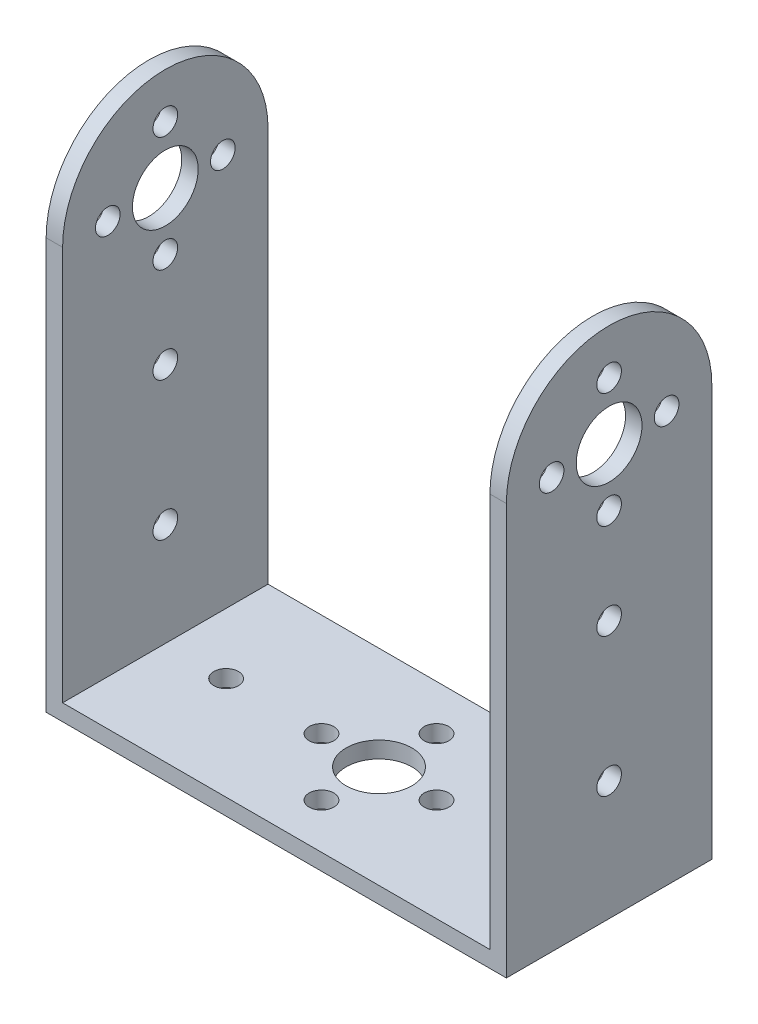
ISO-10303-21;
HEADER;
FILE_DESCRIPTION(('STEP AP214'),'2;1');
FILE_NAME('part.step','',(''),(''),'','','');
FILE_SCHEMA(('AUTOMOTIVE_DESIGN { 1 0 10303 214 1 1 1 1 }'));
ENDSEC;
DATA;
#1=APPLICATION_CONTEXT('core data for automotive mechanical design processes');
#2=APPLICATION_PROTOCOL_DEFINITION('international standard','automotive_design',2000,#1);
#3=PRODUCT_CONTEXT('',#1,'mechanical');
#4=PRODUCT('Part','Part','',(#3));
#5=PRODUCT_RELATED_PRODUCT_CATEGORY('part','',(#4));
#6=PRODUCT_DEFINITION_FORMATION('','',#4);
#7=PRODUCT_DEFINITION_CONTEXT('part definition',#1,'design');
#8=PRODUCT_DEFINITION('design','',#6,#7);
#9=PRODUCT_DEFINITION_SHAPE('','',#8);
#10=(LENGTH_UNIT() NAMED_UNIT(*) SI_UNIT(.MILLI.,.METRE.));
#11=(NAMED_UNIT(*) PLANE_ANGLE_UNIT() SI_UNIT($,.RADIAN.));
#12=(NAMED_UNIT(*) SI_UNIT($,.STERADIAN.) SOLID_ANGLE_UNIT());
#13=UNCERTAINTY_MEASURE_WITH_UNIT(LENGTH_MEASURE(1.E-05),#10,'distance_accuracy_value','');
#14=(GEOMETRIC_REPRESENTATION_CONTEXT(3) GLOBAL_UNCERTAINTY_ASSIGNED_CONTEXT((#13)) GLOBAL_UNIT_ASSIGNED_CONTEXT((#10,
#11,#12)) REPRESENTATION_CONTEXT('',''));
#15=CARTESIAN_POINT('',(0.,0.,0.));
#16=DIRECTION('',(0.,0.,1.));
#17=DIRECTION('',(1.,0.,0.));
#18=AXIS2_PLACEMENT_3D('',#15,#16,#17);
#19=CARTESIAN_POINT('',(0.,2.,0.));
#20=DIRECTION('',(0.,1.,0.));
#21=DIRECTION('',(0.,0.,1.));
#22=AXIS2_PLACEMENT_3D('',#19,#20,#21);
#23=PLANE('',#22);
#24=CARTESIAN_POINT('',(18.6,2.,0.));
#25=DIRECTION('',(0.,1.,0.));
#26=DIRECTION('',(0.,0.,1.));
#27=AXIS2_PLACEMENT_3D('',#24,#25,#26);
#28=CIRCLE('',#27,1.5);
#29=CARTESIAN_POINT('',(18.6,2.,1.5));
#30=VERTEX_POINT('',#29);
#31=EDGE_CURVE('E223',#30,#30,#28,.T.);
#32=ORIENTED_EDGE('',*,*,#31,.F.);
#33=EDGE_LOOP('',(#32));
#34=FACE_BOUND('',#33,.T.);
#35=CARTESIAN_POINT('',(0.,2.,7.));
#36=DIRECTION('',(0.,1.,0.));
#37=DIRECTION('',(0.,0.,1.));
#38=AXIS2_PLACEMENT_3D('',#35,#36,#37);
#39=CIRCLE('',#38,1.5);
#40=CARTESIAN_POINT('',(0.,2.,8.5));
#41=VERTEX_POINT('',#40);
#42=EDGE_CURVE('E235',#41,#41,#39,.T.);
#43=ORIENTED_EDGE('',*,*,#42,.F.);
#44=EDGE_LOOP('',(#43));
#45=FACE_BOUND('',#44,.T.);
#46=CARTESIAN_POINT('',(0.,2.,-7.));
#47=DIRECTION('',(0.,1.,0.));
#48=DIRECTION('',(0.,0.,1.));
#49=AXIS2_PLACEMENT_3D('',#46,#47,#48);
#50=CIRCLE('',#49,1.5);
#51=CARTESIAN_POINT('',(0.,2.,-5.5));
#52=VERTEX_POINT('',#51);
#53=EDGE_CURVE('E247',#52,#52,#50,.T.);
#54=ORIENTED_EDGE('',*,*,#53,.F.);
#55=EDGE_LOOP('',(#54));
#56=FACE_BOUND('',#55,.T.);
#57=DIRECTION('',(0.,0.,1.));
#58=VECTOR('',#57,1.);
#59=CARTESIAN_POINT('',(-26.,2.,12.5));
#60=LINE('',#59,#58);
#61=CARTESIAN_POINT('',(-26.,2.,-12.5));
#62=VERTEX_POINT('',#61);
#63=CARTESIAN_POINT('',(-26.,2.,12.5));
#64=VERTEX_POINT('',#63);
#65=EDGE_CURVE('E40',#62,#64,#60,.T.);
#66=ORIENTED_EDGE('',*,*,#65,.T.);
#67=DIRECTION('',(1.,0.,0.));
#68=VECTOR('',#67,1.);
#69=CARTESIAN_POINT('',(26.,2.,12.5));
#70=LINE('',#69,#68);
#71=CARTESIAN_POINT('',(26.,2.,12.5));
#72=VERTEX_POINT('',#71);
#73=EDGE_CURVE('E262',#64,#72,#70,.T.);
#74=ORIENTED_EDGE('',*,*,#73,.T.);
#75=DIRECTION('',(0.,0.,-1.));
#76=VECTOR('',#75,1.);
#77=CARTESIAN_POINT('',(26.,2.,12.5));
#78=LINE('',#77,#76);
#79=CARTESIAN_POINT('',(26.,2.,-12.5));
#80=VERTEX_POINT('',#79);
#81=EDGE_CURVE('E46',#72,#80,#78,.T.);
#82=ORIENTED_EDGE('',*,*,#81,.T.);
#83=DIRECTION('',(-1.,0.,0.));
#84=VECTOR('',#83,1.);
#85=CARTESIAN_POINT('',(26.,2.,-12.5));
#86=LINE('',#85,#84);
#87=EDGE_CURVE('E11',#80,#62,#86,.T.);
#88=ORIENTED_EDGE('',*,*,#87,.T.);
#89=EDGE_LOOP('',(#66,#74,#82,#88));
#90=FACE_BOUND('',#89,.T.);
#91=CARTESIAN_POINT('',(0.,2.,0.));
#92=DIRECTION('',(0.,1.,0.));
#93=DIRECTION('',(0.,0.,1.));
#94=AXIS2_PLACEMENT_3D('',#91,#92,#93);
#95=CIRCLE('',#94,4.);
#96=CARTESIAN_POINT('',(0.,2.,4.));
#97=VERTEX_POINT('',#96);
#98=EDGE_CURVE('E253',#97,#97,#95,.T.);
#99=ORIENTED_EDGE('',*,*,#98,.F.);
#100=EDGE_LOOP('',(#99));
#101=FACE_BOUND('',#100,.T.);
#102=CARTESIAN_POINT('',(7.,2.,0.));
#103=DIRECTION('',(0.,1.,0.));
#104=DIRECTION('',(0.,0.,1.));
#105=AXIS2_PLACEMENT_3D('',#102,#103,#104);
#106=CIRCLE('',#105,1.5);
#107=CARTESIAN_POINT('',(7.,2.,1.5));
#108=VERTEX_POINT('',#107);
#109=EDGE_CURVE('E241',#108,#108,#106,.T.);
#110=ORIENTED_EDGE('',*,*,#109,.F.);
#111=EDGE_LOOP('',(#110));
#112=FACE_BOUND('',#111,.T.);
#113=CARTESIAN_POINT('',(-7.,2.,0.));
#114=DIRECTION('',(0.,1.,0.));
#115=DIRECTION('',(0.,0.,1.));
#116=AXIS2_PLACEMENT_3D('',#113,#114,#115);
#117=CIRCLE('',#116,1.5);
#118=CARTESIAN_POINT('',(-7.,2.,1.5));
#119=VERTEX_POINT('',#118);
#120=EDGE_CURVE('E229',#119,#119,#117,.T.);
#121=ORIENTED_EDGE('',*,*,#120,.F.);
#122=EDGE_LOOP('',(#121));
#123=FACE_BOUND('',#122,.T.);
#124=CARTESIAN_POINT('',(-18.6,2.,0.));
#125=DIRECTION('',(0.,1.,0.));
#126=DIRECTION('',(0.,0.,1.));
#127=AXIS2_PLACEMENT_3D('',#124,#125,#126);
#128=CIRCLE('',#127,1.5);
#129=CARTESIAN_POINT('',(-18.6,2.,1.5));
#130=VERTEX_POINT('',#129);
#131=EDGE_CURVE('E216',#130,#130,#128,.T.);
#132=ORIENTED_EDGE('',*,*,#131,.F.);
#133=EDGE_LOOP('',(#132));
#134=FACE_BOUND('',#133,.T.);
#135=ADVANCED_FACE('F36',(#34,#45,#56,#90,#101,#112,#123,#134),#23,.T.);
#136=CARTESIAN_POINT('',(0.,0.,0.));
#137=DIRECTION('',(0.,1.,0.));
#138=DIRECTION('',(0.,0.,1.));
#139=AXIS2_PLACEMENT_3D('',#136,#137,#138);
#140=PLANE('',#139);
#141=CARTESIAN_POINT('',(18.6,0.,0.));
#142=DIRECTION('',(0.,1.,0.));
#143=DIRECTION('',(0.,0.,1.));
#144=AXIS2_PLACEMENT_3D('',#141,#142,#143);
#145=CIRCLE('',#144,1.5);
#146=CARTESIAN_POINT('',(18.6,0.,1.5));
#147=VERTEX_POINT('',#146);
#148=EDGE_CURVE('E219',#147,#147,#145,.T.);
#149=ORIENTED_EDGE('',*,*,#148,.T.);
#150=EDGE_LOOP('',(#149));
#151=FACE_BOUND('',#150,.T.);
#152=CARTESIAN_POINT('',(0.,0.,7.));
#153=DIRECTION('',(0.,1.,0.));
#154=DIRECTION('',(0.,0.,1.));
#155=AXIS2_PLACEMENT_3D('',#152,#153,#154);
#156=CIRCLE('',#155,1.5);
#157=CARTESIAN_POINT('',(0.,0.,8.5));
#158=VERTEX_POINT('',#157);
#159=EDGE_CURVE('E232',#158,#158,#156,.T.);
#160=ORIENTED_EDGE('',*,*,#159,.T.);
#161=EDGE_LOOP('',(#160));
#162=FACE_BOUND('',#161,.T.);
#163=CARTESIAN_POINT('',(0.,0.,-7.));
#164=DIRECTION('',(0.,1.,0.));
#165=DIRECTION('',(0.,0.,1.));
#166=AXIS2_PLACEMENT_3D('',#163,#164,#165);
#167=CIRCLE('',#166,1.5);
#168=CARTESIAN_POINT('',(0.,0.,-5.5));
#169=VERTEX_POINT('',#168);
#170=EDGE_CURVE('E244',#169,#169,#167,.T.);
#171=ORIENTED_EDGE('',*,*,#170,.T.);
#172=EDGE_LOOP('',(#171));
#173=FACE_BOUND('',#172,.T.);
#174=DIRECTION('',(1.,0.,0.));
#175=VECTOR('',#174,1.);
#176=CARTESIAN_POINT('',(26.,0.,12.5));
#177=LINE('',#176,#175);
#178=CARTESIAN_POINT('',(-28.,0.,12.5));
#179=VERTEX_POINT('',#178);
#180=CARTESIAN_POINT('',(28.,0.,12.5));
#181=VERTEX_POINT('',#180);
#182=EDGE_CURVE('E115',#179,#181,#177,.T.);
#183=ORIENTED_EDGE('',*,*,#182,.F.);
#184=DIRECTION('',(0.,0.,1.));
#185=VECTOR('',#184,1.);
#186=CARTESIAN_POINT('',(-28.,0.,-12.5));
#187=LINE('',#186,#185);
#188=CARTESIAN_POINT('',(-28.,0.,-12.5));
#189=VERTEX_POINT('',#188);
#190=EDGE_CURVE('E118',#189,#179,#187,.T.);
#191=ORIENTED_EDGE('',*,*,#190,.F.);
#192=DIRECTION('',(-1.,0.,0.));
#193=VECTOR('',#192,1.);
#194=CARTESIAN_POINT('',(26.,0.,-12.5));
#195=LINE('',#194,#193);
#196=CARTESIAN_POINT('',(28.,0.,-12.5));
#197=VERTEX_POINT('',#196);
#198=EDGE_CURVE('E104',#197,#189,#195,.T.);
#199=ORIENTED_EDGE('',*,*,#198,.F.);
#200=DIRECTION('',(0.,0.,-1.));
#201=VECTOR('',#200,1.);
#202=CARTESIAN_POINT('',(28.,0.,12.5));
#203=LINE('',#202,#201);
#204=EDGE_CURVE('E198',#181,#197,#203,.T.);
#205=ORIENTED_EDGE('',*,*,#204,.F.);
#206=EDGE_LOOP('',(#183,#191,#199,#205));
#207=FACE_BOUND('',#206,.T.);
#208=CARTESIAN_POINT('',(0.,0.,0.));
#209=DIRECTION('',(0.,1.,0.));
#210=DIRECTION('',(0.,0.,1.));
#211=AXIS2_PLACEMENT_3D('',#208,#209,#210);
#212=CIRCLE('',#211,4.);
#213=CARTESIAN_POINT('',(0.,0.,4.));
#214=VERTEX_POINT('',#213);
#215=EDGE_CURVE('E250',#214,#214,#212,.T.);
#216=ORIENTED_EDGE('',*,*,#215,.T.);
#217=EDGE_LOOP('',(#216));
#218=FACE_BOUND('',#217,.T.);
#219=CARTESIAN_POINT('',(7.,0.,0.));
#220=DIRECTION('',(0.,1.,0.));
#221=DIRECTION('',(0.,0.,1.));
#222=AXIS2_PLACEMENT_3D('',#219,#220,#221);
#223=CIRCLE('',#222,1.5);
#224=CARTESIAN_POINT('',(7.,0.,1.5));
#225=VERTEX_POINT('',#224);
#226=EDGE_CURVE('E238',#225,#225,#223,.T.);
#227=ORIENTED_EDGE('',*,*,#226,.T.);
#228=EDGE_LOOP('',(#227));
#229=FACE_BOUND('',#228,.T.);
#230=CARTESIAN_POINT('',(-7.,0.,0.));
#231=DIRECTION('',(0.,1.,0.));
#232=DIRECTION('',(0.,0.,1.));
#233=AXIS2_PLACEMENT_3D('',#230,#231,#232);
#234=CIRCLE('',#233,1.5);
#235=CARTESIAN_POINT('',(-7.,0.,1.5));
#236=VERTEX_POINT('',#235);
#237=EDGE_CURVE('E226',#236,#236,#234,.T.);
#238=ORIENTED_EDGE('',*,*,#237,.T.);
#239=EDGE_LOOP('',(#238));
#240=FACE_BOUND('',#239,.T.);
#241=CARTESIAN_POINT('',(-18.6,0.,0.));
#242=DIRECTION('',(0.,1.,0.));
#243=DIRECTION('',(0.,0.,1.));
#244=AXIS2_PLACEMENT_3D('',#241,#242,#243);
#245=CIRCLE('',#244,1.5);
#246=CARTESIAN_POINT('',(-18.6,0.,1.5));
#247=VERTEX_POINT('',#246);
#248=EDGE_CURVE('E220',#247,#247,#245,.T.);
#249=ORIENTED_EDGE('',*,*,#248,.T.);
#250=EDGE_LOOP('',(#249));
#251=FACE_BOUND('',#250,.T.);
#252=ADVANCED_FACE('F119',(#151,#162,#173,#207,#218,#229,#240,#251),#140,.F.);
#253=CARTESIAN_POINT('',(26.,2.,12.5));
#254=DIRECTION('',(0.,0.,-1.));
#255=DIRECTION('',(-1.,0.,0.));
#256=AXIS2_PLACEMENT_3D('',#253,#254,#255);
#257=PLANE('',#256);
#258=ORIENTED_EDGE('',*,*,#182,.T.);
#259=DIRECTION('',(0.,-1.,0.));
#260=VECTOR('',#259,1.);
#261=CARTESIAN_POINT('',(28.,0.,12.5));
#262=LINE('',#261,#260);
#263=CARTESIAN_POINT('',(28.,50.,12.5));
#264=VERTEX_POINT('',#263);
#265=EDGE_CURVE('E195',#264,#181,#262,.T.);
#266=ORIENTED_EDGE('',*,*,#265,.F.);
#267=DIRECTION('',(-1.,0.,0.));
#268=VECTOR('',#267,1.);
#269=CARTESIAN_POINT('',(28.,50.,12.5));
#270=LINE('',#269,#268);
#271=CARTESIAN_POINT('',(26.,50.,12.5));
#272=VERTEX_POINT('',#271);
#273=EDGE_CURVE('E204',#264,#272,#270,.T.);
#274=ORIENTED_EDGE('',*,*,#273,.T.);
#275=DIRECTION('',(0.,-1.,0.));
#276=VECTOR('',#275,1.);
#277=CARTESIAN_POINT('',(26.,0.,12.5));
#278=LINE('',#277,#276);
#279=EDGE_CURVE('E192',#272,#72,#278,.T.);
#280=ORIENTED_EDGE('',*,*,#279,.T.);
#281=ORIENTED_EDGE('',*,*,#73,.F.);
#282=DIRECTION('',(0.,1.,0.));
#283=VECTOR('',#282,1.);
#284=CARTESIAN_POINT('',(-26.,0.,12.5));
#285=LINE('',#284,#283);
#286=CARTESIAN_POINT('',(-26.,50.,12.5));
#287=VERTEX_POINT('',#286);
#288=EDGE_CURVE('E62',#64,#287,#285,.T.);
#289=ORIENTED_EDGE('',*,*,#288,.T.);
#290=DIRECTION('',(1.,0.,0.));
#291=VECTOR('',#290,1.);
#292=CARTESIAN_POINT('',(-28.,50.,12.5));
#293=LINE('',#292,#291);
#294=CARTESIAN_POINT('',(-28.,50.,12.5));
#295=VERTEX_POINT('',#294);
#296=EDGE_CURVE('E149',#295,#287,#293,.T.);
#297=ORIENTED_EDGE('',*,*,#296,.F.);
#298=DIRECTION('',(0.,1.,0.));
#299=VECTOR('',#298,1.);
#300=CARTESIAN_POINT('',(-28.,0.,12.5));
#301=LINE('',#300,#299);
#302=EDGE_CURVE('E123',#179,#295,#301,.T.);
#303=ORIENTED_EDGE('',*,*,#302,.F.);
#304=EDGE_LOOP('',(#258,#266,#274,#280,#281,#289,#297,#303));
#305=FACE_BOUND('',#304,.T.);
#306=ADVANCED_FACE('F38',(#305),#257,.F.);
#307=CARTESIAN_POINT('',(26.,2.,-12.5));
#308=DIRECTION('',(0.,0.,1.));
#309=DIRECTION('',(1.,0.,0.));
#310=AXIS2_PLACEMENT_3D('',#307,#308,#309);
#311=PLANE('',#310);
#312=ORIENTED_EDGE('',*,*,#198,.T.);
#313=DIRECTION('',(0.,-1.,0.));
#314=VECTOR('',#313,1.);
#315=CARTESIAN_POINT('',(-28.,0.,-12.5));
#316=LINE('',#315,#314);
#317=CARTESIAN_POINT('',(-28.,50.,-12.5));
#318=VERTEX_POINT('',#317);
#319=EDGE_CURVE('E109',#318,#189,#316,.T.);
#320=ORIENTED_EDGE('',*,*,#319,.F.);
#321=DIRECTION('',(1.,0.,0.));
#322=VECTOR('',#321,1.);
#323=CARTESIAN_POINT('',(-28.,50.,-12.5));
#324=LINE('',#323,#322);
#325=CARTESIAN_POINT('',(-26.,50.,-12.5));
#326=VERTEX_POINT('',#325);
#327=EDGE_CURVE('E139',#318,#326,#324,.T.);
#328=ORIENTED_EDGE('',*,*,#327,.T.);
#329=DIRECTION('',(0.,-1.,0.));
#330=VECTOR('',#329,1.);
#331=CARTESIAN_POINT('',(-26.,0.,-12.5));
#332=LINE('',#331,#330);
#333=EDGE_CURVE('E144',#326,#62,#332,.T.);
#334=ORIENTED_EDGE('',*,*,#333,.T.);
#335=ORIENTED_EDGE('',*,*,#87,.F.);
#336=DIRECTION('',(0.,1.,0.));
#337=VECTOR('',#336,1.);
#338=CARTESIAN_POINT('',(26.,0.,-12.5));
#339=LINE('',#338,#337);
#340=CARTESIAN_POINT('',(26.,50.,-12.5));
#341=VERTEX_POINT('',#340);
#342=EDGE_CURVE('E54',#80,#341,#339,.T.);
#343=ORIENTED_EDGE('',*,*,#342,.T.);
#344=DIRECTION('',(-1.,0.,0.));
#345=VECTOR('',#344,1.);
#346=CARTESIAN_POINT('',(28.,50.,-12.5));
#347=LINE('',#346,#345);
#348=CARTESIAN_POINT('',(28.,50.,-12.5));
#349=VERTEX_POINT('',#348);
#350=EDGE_CURVE('E213',#349,#341,#347,.T.);
#351=ORIENTED_EDGE('',*,*,#350,.F.);
#352=DIRECTION('',(0.,1.,0.));
#353=VECTOR('',#352,1.);
#354=CARTESIAN_POINT('',(28.,0.,-12.5));
#355=LINE('',#354,#353);
#356=EDGE_CURVE('E111',#197,#349,#355,.T.);
#357=ORIENTED_EDGE('',*,*,#356,.F.);
#358=EDGE_LOOP('',(#312,#320,#328,#334,#335,#343,#351,#357));
#359=FACE_BOUND('',#358,.T.);
#360=ADVANCED_FACE('F106',(#359),#311,.F.);
#361=CARTESIAN_POINT('',(0.,2.,0.));
#362=DIRECTION('',(0.,-1.,0.));
#363=DIRECTION('',(0.,0.,-1.));
#364=AXIS2_PLACEMENT_3D('',#361,#362,#363);
#365=CYLINDRICAL_SURFACE('',#364,4.);
#366=ORIENTED_EDGE('',*,*,#98,.T.);
#367=EDGE_LOOP('',(#366));
#368=FACE_BOUND('',#367,.T.);
#369=ORIENTED_EDGE('',*,*,#215,.F.);
#370=EDGE_LOOP('',(#369));
#371=FACE_BOUND('',#370,.T.);
#372=ADVANCED_FACE('F346',(#368,#371),#365,.F.);
#373=CARTESIAN_POINT('',(0.,2.,-7.));
#374=DIRECTION('',(0.,-1.,0.));
#375=DIRECTION('',(0.,0.,-1.));
#376=AXIS2_PLACEMENT_3D('',#373,#374,#375);
#377=CYLINDRICAL_SURFACE('',#376,1.5);
#378=ORIENTED_EDGE('',*,*,#53,.T.);
#379=EDGE_LOOP('',(#378));
#380=FACE_BOUND('',#379,.T.);
#381=ORIENTED_EDGE('',*,*,#170,.F.);
#382=EDGE_LOOP('',(#381));
#383=FACE_BOUND('',#382,.T.);
#384=ADVANCED_FACE('F353',(#380,#383),#377,.F.);
#385=CARTESIAN_POINT('',(7.,2.,0.));
#386=DIRECTION('',(0.,-1.,0.));
#387=DIRECTION('',(0.,0.,-1.));
#388=AXIS2_PLACEMENT_3D('',#385,#386,#387);
#389=CYLINDRICAL_SURFACE('',#388,1.5);
#390=ORIENTED_EDGE('',*,*,#109,.T.);
#391=EDGE_LOOP('',(#390));
#392=FACE_BOUND('',#391,.T.);
#393=ORIENTED_EDGE('',*,*,#226,.F.);
#394=EDGE_LOOP('',(#393));
#395=FACE_BOUND('',#394,.T.);
#396=ADVANCED_FACE('F483',(#392,#395),#389,.F.);
#397=CARTESIAN_POINT('',(0.,2.,7.));
#398=DIRECTION('',(0.,-1.,0.));
#399=DIRECTION('',(0.,0.,-1.));
#400=AXIS2_PLACEMENT_3D('',#397,#398,#399);
#401=CYLINDRICAL_SURFACE('',#400,1.5);
#402=ORIENTED_EDGE('',*,*,#42,.T.);
#403=EDGE_LOOP('',(#402));
#404=FACE_BOUND('',#403,.T.);
#405=ORIENTED_EDGE('',*,*,#159,.F.);
#406=EDGE_LOOP('',(#405));
#407=FACE_BOUND('',#406,.T.);
#408=ADVANCED_FACE('F473',(#404,#407),#401,.F.);
#409=CARTESIAN_POINT('',(-7.,2.,0.));
#410=DIRECTION('',(0.,-1.,0.));
#411=DIRECTION('',(0.,0.,-1.));
#412=AXIS2_PLACEMENT_3D('',#409,#410,#411);
#413=CYLINDRICAL_SURFACE('',#412,1.5);
#414=ORIENTED_EDGE('',*,*,#120,.T.);
#415=EDGE_LOOP('',(#414));
#416=FACE_BOUND('',#415,.T.);
#417=ORIENTED_EDGE('',*,*,#237,.F.);
#418=EDGE_LOOP('',(#417));
#419=FACE_BOUND('',#418,.T.);
#420=ADVANCED_FACE('F463',(#416,#419),#413,.F.);
#421=CARTESIAN_POINT('',(18.6,2.,0.));
#422=DIRECTION('',(0.,-1.,0.));
#423=DIRECTION('',(0.,0.,-1.));
#424=AXIS2_PLACEMENT_3D('',#421,#422,#423);
#425=CYLINDRICAL_SURFACE('',#424,1.5);
#426=ORIENTED_EDGE('',*,*,#31,.T.);
#427=EDGE_LOOP('',(#426));
#428=FACE_BOUND('',#427,.T.);
#429=ORIENTED_EDGE('',*,*,#148,.F.);
#430=EDGE_LOOP('',(#429));
#431=FACE_BOUND('',#430,.T.);
#432=ADVANCED_FACE('F453',(#428,#431),#425,.F.);
#433=CARTESIAN_POINT('',(-18.6,2.,0.));
#434=DIRECTION('',(0.,-1.,0.));
#435=DIRECTION('',(0.,0.,-1.));
#436=AXIS2_PLACEMENT_3D('',#433,#434,#435);
#437=CYLINDRICAL_SURFACE('',#436,1.5);
#438=ORIENTED_EDGE('',*,*,#131,.T.);
#439=EDGE_LOOP('',(#438));
#440=FACE_BOUND('',#439,.T.);
#441=ORIENTED_EDGE('',*,*,#248,.F.);
#442=EDGE_LOOP('',(#441));
#443=FACE_BOUND('',#442,.T.);
#444=ADVANCED_FACE('F311',(#440,#443),#437,.F.);
#445=CARTESIAN_POINT('',(26.,50.,0.));
#446=DIRECTION('',(-1.,0.,0.));
#447=DIRECTION('',(0.,0.,1.));
#448=AXIS2_PLACEMENT_3D('',#445,#446,#447);
#449=PLANE('',#448);
#450=CARTESIAN_POINT('',(26.,14.53,0.));
#451=DIRECTION('',(1.,0.,0.));
#452=DIRECTION('',(0.,0.,-1.));
#453=AXIS2_PLACEMENT_3D('',#450,#451,#452);
#454=CIRCLE('',#453,1.5);
#455=CARTESIAN_POINT('',(26.,14.53,-1.5));
#456=VERTEX_POINT('',#455);
#457=EDGE_CURVE('E156',#456,#456,#454,.T.);
#458=ORIENTED_EDGE('',*,*,#457,.T.);
#459=EDGE_LOOP('',(#458));
#460=FACE_BOUND('',#459,.T.);
#461=CARTESIAN_POINT('',(26.,50.,7.));
#462=DIRECTION('',(1.,0.,0.));
#463=DIRECTION('',(0.,0.,-1.));
#464=AXIS2_PLACEMENT_3D('',#461,#462,#463);
#465=CIRCLE('',#464,1.5);
#466=CARTESIAN_POINT('',(26.,50.,5.5));
#467=VERTEX_POINT('',#466);
#468=EDGE_CURVE('E162',#467,#467,#465,.T.);
#469=ORIENTED_EDGE('',*,*,#468,.T.);
#470=EDGE_LOOP('',(#469));
#471=FACE_BOUND('',#470,.T.);
#472=CARTESIAN_POINT('',(26.,50.,-7.));
#473=DIRECTION('',(1.,0.,0.));
#474=DIRECTION('',(0.,0.,-1.));
#475=AXIS2_PLACEMENT_3D('',#472,#473,#474);
#476=CIRCLE('',#475,1.5);
#477=CARTESIAN_POINT('',(26.,50.,-8.5));
#478=VERTEX_POINT('',#477);
#479=EDGE_CURVE('E174',#478,#478,#476,.T.);
#480=ORIENTED_EDGE('',*,*,#479,.T.);
#481=EDGE_LOOP('',(#480));
#482=FACE_BOUND('',#481,.T.);
#483=CARTESIAN_POINT('',(26.,50.,0.));
#484=DIRECTION('',(1.,0.,0.));
#485=DIRECTION('',(0.,0.,-1.));
#486=AXIS2_PLACEMENT_3D('',#483,#484,#485);
#487=CIRCLE('',#486,4.);
#488=CARTESIAN_POINT('',(26.,50.,-4.));
#489=VERTEX_POINT('',#488);
#490=EDGE_CURVE('E186',#489,#489,#487,.T.);
#491=ORIENTED_EDGE('',*,*,#490,.T.);
#492=EDGE_LOOP('',(#491));
#493=FACE_BOUND('',#492,.T.);
#494=CARTESIAN_POINT('',(26.,43.,0.));
#495=DIRECTION('',(1.,0.,0.));
#496=DIRECTION('',(0.,0.,-1.));
#497=AXIS2_PLACEMENT_3D('',#494,#495,#496);
#498=CIRCLE('',#497,1.5);
#499=CARTESIAN_POINT('',(26.,43.,-1.5));
#500=VERTEX_POINT('',#499);
#501=EDGE_CURVE('E180',#500,#500,#498,.T.);
#502=ORIENTED_EDGE('',*,*,#501,.T.);
#503=EDGE_LOOP('',(#502));
#504=FACE_BOUND('',#503,.T.);
#505=CARTESIAN_POINT('',(26.,57.,0.));
#506=DIRECTION('',(1.,0.,0.));
#507=DIRECTION('',(0.,0.,-1.));
#508=AXIS2_PLACEMENT_3D('',#505,#506,#507);
#509=CIRCLE('',#508,1.5);
#510=CARTESIAN_POINT('',(26.,57.,-1.5));
#511=VERTEX_POINT('',#510);
#512=EDGE_CURVE('E168',#511,#511,#509,.T.);
#513=ORIENTED_EDGE('',*,*,#512,.T.);
#514=EDGE_LOOP('',(#513));
#515=FACE_BOUND('',#514,.T.);
#516=CARTESIAN_POINT('',(26.,31.4,0.));
#517=DIRECTION('',(1.,0.,0.));
#518=DIRECTION('',(0.,0.,-1.));
#519=AXIS2_PLACEMENT_3D('',#516,#517,#518);
#520=CIRCLE('',#519,1.5);
#521=CARTESIAN_POINT('',(26.,31.4,-1.5));
#522=VERTEX_POINT('',#521);
#523=EDGE_CURVE('E155',#522,#522,#520,.T.);
#524=ORIENTED_EDGE('',*,*,#523,.T.);
#525=EDGE_LOOP('',(#524));
#526=FACE_BOUND('',#525,.T.);
#527=ORIENTED_EDGE('',*,*,#81,.F.);
#528=ORIENTED_EDGE('',*,*,#279,.F.);
#529=CARTESIAN_POINT('',(26.,50.,0.));
#530=DIRECTION('',(1.,0.,0.));
#531=DIRECTION('',(0.,0.,1.));
#532=AXIS2_PLACEMENT_3D('',#529,#530,#531);
#533=CIRCLE('',#532,12.5);
#534=EDGE_CURVE('E199',#341,#272,#533,.T.);
#535=ORIENTED_EDGE('',*,*,#534,.F.);
#536=ORIENTED_EDGE('',*,*,#342,.F.);
#537=EDGE_LOOP('',(#527,#528,#535,#536));
#538=FACE_BOUND('',#537,.T.);
#539=ADVANCED_FACE('F283',(#460,#471,#482,#493,#504,#515,#526,#538),#449,.T.);
#540=CARTESIAN_POINT('',(28.,50.,0.));
#541=DIRECTION('',(-1.,0.,0.));
#542=DIRECTION('',(0.,0.,1.));
#543=AXIS2_PLACEMENT_3D('',#540,#541,#542);
#544=PLANE('',#543);
#545=CARTESIAN_POINT('',(28.,31.4,0.));
#546=DIRECTION('',(1.,0.,0.));
#547=DIRECTION('',(0.,0.,-1.));
#548=AXIS2_PLACEMENT_3D('',#545,#546,#547);
#549=CIRCLE('',#548,1.5);
#550=CARTESIAN_POINT('',(28.,31.4,-1.5));
#551=VERTEX_POINT('',#550);
#552=EDGE_CURVE('E159',#551,#551,#549,.T.);
#553=ORIENTED_EDGE('',*,*,#552,.F.);
#554=EDGE_LOOP('',(#553));
#555=FACE_BOUND('',#554,.T.);
#556=CARTESIAN_POINT('',(28.,57.,0.));
#557=DIRECTION('',(1.,0.,0.));
#558=DIRECTION('',(0.,0.,-1.));
#559=AXIS2_PLACEMENT_3D('',#556,#557,#558);
#560=CIRCLE('',#559,1.5);
#561=CARTESIAN_POINT('',(28.,57.,-1.5));
#562=VERTEX_POINT('',#561);
#563=EDGE_CURVE('E171',#562,#562,#560,.T.);
#564=ORIENTED_EDGE('',*,*,#563,.F.);
#565=EDGE_LOOP('',(#564));
#566=FACE_BOUND('',#565,.T.);
#567=CARTESIAN_POINT('',(28.,43.,0.));
#568=DIRECTION('',(1.,0.,0.));
#569=DIRECTION('',(0.,0.,-1.));
#570=AXIS2_PLACEMENT_3D('',#567,#568,#569);
#571=CIRCLE('',#570,1.5);
#572=CARTESIAN_POINT('',(28.,43.,-1.5));
#573=VERTEX_POINT('',#572);
#574=EDGE_CURVE('E183',#573,#573,#571,.T.);
#575=ORIENTED_EDGE('',*,*,#574,.F.);
#576=EDGE_LOOP('',(#575));
#577=FACE_BOUND('',#576,.T.);
#578=ORIENTED_EDGE('',*,*,#265,.T.);
#579=ORIENTED_EDGE('',*,*,#204,.T.);
#580=ORIENTED_EDGE('',*,*,#356,.T.);
#581=CARTESIAN_POINT('',(28.,50.,0.));
#582=DIRECTION('',(1.,0.,0.));
#583=DIRECTION('',(0.,0.,1.));
#584=AXIS2_PLACEMENT_3D('',#581,#582,#583);
#585=CIRCLE('',#584,12.5);
#586=EDGE_CURVE('E202',#349,#264,#585,.T.);
#587=ORIENTED_EDGE('',*,*,#586,.T.);
#588=EDGE_LOOP('',(#578,#579,#580,#587));
#589=FACE_BOUND('',#588,.T.);
#590=CARTESIAN_POINT('',(28.,50.,0.));
#591=DIRECTION('',(1.,0.,0.));
#592=DIRECTION('',(0.,0.,-1.));
#593=AXIS2_PLACEMENT_3D('',#590,#591,#592);
#594=CIRCLE('',#593,4.);
#595=CARTESIAN_POINT('',(28.,50.,-4.));
#596=VERTEX_POINT('',#595);
#597=EDGE_CURVE('E189',#596,#596,#594,.T.);
#598=ORIENTED_EDGE('',*,*,#597,.F.);
#599=EDGE_LOOP('',(#598));
#600=FACE_BOUND('',#599,.T.);
#601=CARTESIAN_POINT('',(28.,50.,-7.));
#602=DIRECTION('',(1.,0.,0.));
#603=DIRECTION('',(0.,0.,-1.));
#604=AXIS2_PLACEMENT_3D('',#601,#602,#603);
#605=CIRCLE('',#604,1.5);
#606=CARTESIAN_POINT('',(28.,50.,-8.5));
#607=VERTEX_POINT('',#606);
#608=EDGE_CURVE('E177',#607,#607,#605,.T.);
#609=ORIENTED_EDGE('',*,*,#608,.F.);
#610=EDGE_LOOP('',(#609));
#611=FACE_BOUND('',#610,.T.);
#612=CARTESIAN_POINT('',(28.,50.,7.));
#613=DIRECTION('',(1.,0.,0.));
#614=DIRECTION('',(0.,0.,-1.));
#615=AXIS2_PLACEMENT_3D('',#612,#613,#614);
#616=CIRCLE('',#615,1.5);
#617=CARTESIAN_POINT('',(28.,50.,5.5));
#618=VERTEX_POINT('',#617);
#619=EDGE_CURVE('E165',#618,#618,#616,.T.);
#620=ORIENTED_EDGE('',*,*,#619,.F.);
#621=EDGE_LOOP('',(#620));
#622=FACE_BOUND('',#621,.T.);
#623=CARTESIAN_POINT('',(28.,14.53,0.));
#624=DIRECTION('',(1.,0.,0.));
#625=DIRECTION('',(0.,0.,-1.));
#626=AXIS2_PLACEMENT_3D('',#623,#624,#625);
#627=CIRCLE('',#626,1.5);
#628=CARTESIAN_POINT('',(28.,14.53,-1.5));
#629=VERTEX_POINT('',#628);
#630=EDGE_CURVE('E152',#629,#629,#627,.T.);
#631=ORIENTED_EDGE('',*,*,#630,.F.);
#632=EDGE_LOOP('',(#631));
#633=FACE_BOUND('',#632,.T.);
#634=ADVANCED_FACE('F289',(#555,#566,#577,#589,#600,#611,#622,#633),#544,.F.);
#635=CARTESIAN_POINT('',(28.,50.,0.));
#636=DIRECTION('',(-1.,0.,0.));
#637=DIRECTION('',(0.,0.,1.));
#638=AXIS2_PLACEMENT_3D('',#635,#636,#637);
#639=CYLINDRICAL_SURFACE('',#638,12.5);
#640=ORIENTED_EDGE('',*,*,#534,.T.);
#641=ORIENTED_EDGE('',*,*,#273,.F.);
#642=ORIENTED_EDGE('',*,*,#586,.F.);
#643=ORIENTED_EDGE('',*,*,#350,.T.);
#644=EDGE_LOOP('',(#640,#641,#642,#643));
#645=FACE_BOUND('',#644,.T.);
#646=ADVANCED_FACE('F287',(#645),#639,.T.);
#647=CARTESIAN_POINT('',(28.,50.,0.));
#648=DIRECTION('',(-1.,0.,0.));
#649=DIRECTION('',(0.,0.,1.));
#650=AXIS2_PLACEMENT_3D('',#647,#648,#649);
#651=CYLINDRICAL_SURFACE('',#650,4.);
#652=ORIENTED_EDGE('',*,*,#597,.T.);
#653=EDGE_LOOP('',(#652));
#654=FACE_BOUND('',#653,.T.);
#655=ORIENTED_EDGE('',*,*,#490,.F.);
#656=EDGE_LOOP('',(#655));
#657=FACE_BOUND('',#656,.T.);
#658=ADVANCED_FACE('F413',(#654,#657),#651,.F.);
#659=CARTESIAN_POINT('',(28.,43.,0.));
#660=DIRECTION('',(-1.,0.,0.));
#661=DIRECTION('',(0.,0.,1.));
#662=AXIS2_PLACEMENT_3D('',#659,#660,#661);
#663=CYLINDRICAL_SURFACE('',#662,1.5);
#664=ORIENTED_EDGE('',*,*,#574,.T.);
#665=EDGE_LOOP('',(#664));
#666=FACE_BOUND('',#665,.T.);
#667=ORIENTED_EDGE('',*,*,#501,.F.);
#668=EDGE_LOOP('',(#667));
#669=FACE_BOUND('',#668,.T.);
#670=ADVANCED_FACE('F403',(#666,#669),#663,.F.);
#671=CARTESIAN_POINT('',(28.,50.,-7.));
#672=DIRECTION('',(-1.,0.,0.));
#673=DIRECTION('',(0.,0.,1.));
#674=AXIS2_PLACEMENT_3D('',#671,#672,#673);
#675=CYLINDRICAL_SURFACE('',#674,1.5);
#676=ORIENTED_EDGE('',*,*,#608,.T.);
#677=EDGE_LOOP('',(#676));
#678=FACE_BOUND('',#677,.T.);
#679=ORIENTED_EDGE('',*,*,#479,.F.);
#680=EDGE_LOOP('',(#679));
#681=FACE_BOUND('',#680,.T.);
#682=ADVANCED_FACE('F393',(#678,#681),#675,.F.);
#683=CARTESIAN_POINT('',(28.,57.,0.));
#684=DIRECTION('',(-1.,0.,0.));
#685=DIRECTION('',(0.,0.,1.));
#686=AXIS2_PLACEMENT_3D('',#683,#684,#685);
#687=CYLINDRICAL_SURFACE('',#686,1.5);
#688=ORIENTED_EDGE('',*,*,#563,.T.);
#689=EDGE_LOOP('',(#688));
#690=FACE_BOUND('',#689,.T.);
#691=ORIENTED_EDGE('',*,*,#512,.F.);
#692=EDGE_LOOP('',(#691));
#693=FACE_BOUND('',#692,.T.);
#694=ADVANCED_FACE('F332',(#690,#693),#687,.F.);
#695=CARTESIAN_POINT('',(28.,50.,7.));
#696=DIRECTION('',(-1.,0.,0.));
#697=DIRECTION('',(0.,0.,1.));
#698=AXIS2_PLACEMENT_3D('',#695,#696,#697);
#699=CYLINDRICAL_SURFACE('',#698,1.5);
#700=ORIENTED_EDGE('',*,*,#619,.T.);
#701=EDGE_LOOP('',(#700));
#702=FACE_BOUND('',#701,.T.);
#703=ORIENTED_EDGE('',*,*,#468,.F.);
#704=EDGE_LOOP('',(#703));
#705=FACE_BOUND('',#704,.T.);
#706=ADVANCED_FACE('F326',(#702,#705),#699,.F.);
#707=CARTESIAN_POINT('',(28.,31.4,0.));
#708=DIRECTION('',(-1.,0.,0.));
#709=DIRECTION('',(0.,0.,1.));
#710=AXIS2_PLACEMENT_3D('',#707,#708,#709);
#711=CYLINDRICAL_SURFACE('',#710,1.5);
#712=ORIENTED_EDGE('',*,*,#552,.T.);
#713=EDGE_LOOP('',(#712));
#714=FACE_BOUND('',#713,.T.);
#715=ORIENTED_EDGE('',*,*,#523,.F.);
#716=EDGE_LOOP('',(#715));
#717=FACE_BOUND('',#716,.T.);
#718=ADVANCED_FACE('F305',(#714,#717),#711,.F.);
#719=CARTESIAN_POINT('',(28.,14.53,0.));
#720=DIRECTION('',(-1.,0.,0.));
#721=DIRECTION('',(0.,0.,1.));
#722=AXIS2_PLACEMENT_3D('',#719,#720,#721);
#723=CYLINDRICAL_SURFACE('',#722,1.5);
#724=ORIENTED_EDGE('',*,*,#630,.T.);
#725=EDGE_LOOP('',(#724));
#726=FACE_BOUND('',#725,.T.);
#727=ORIENTED_EDGE('',*,*,#457,.F.);
#728=EDGE_LOOP('',(#727));
#729=FACE_BOUND('',#728,.T.);
#730=ADVANCED_FACE('F302',(#726,#729),#723,.F.);
#731=CARTESIAN_POINT('',(-26.,50.,0.));
#732=DIRECTION('',(1.,0.,0.));
#733=DIRECTION('',(0.,0.,-1.));
#734=AXIS2_PLACEMENT_3D('',#731,#732,#733);
#735=PLANE('',#734);
#736=CARTESIAN_POINT('',(-26.,14.53,0.));
#737=DIRECTION('',(-1.,0.,0.));
#738=DIRECTION('',(0.,0.,1.));
#739=AXIS2_PLACEMENT_3D('',#736,#737,#738);
#740=CIRCLE('',#739,1.5);
#741=CARTESIAN_POINT('',(-26.,14.53,1.5));
#742=VERTEX_POINT('',#741);
#743=EDGE_CURVE('E633',#742,#742,#740,.T.);
#744=ORIENTED_EDGE('',*,*,#743,.T.);
#745=EDGE_LOOP('',(#744));
#746=FACE_BOUND('',#745,.T.);
#747=CARTESIAN_POINT('',(-26.,43.,0.));
#748=DIRECTION('',(-1.,0.,0.));
#749=DIRECTION('',(0.,0.,1.));
#750=AXIS2_PLACEMENT_3D('',#747,#748,#749);
#751=CIRCLE('',#750,1.5);
#752=CARTESIAN_POINT('',(-26.,43.,1.5));
#753=VERTEX_POINT('',#752);
#754=EDGE_CURVE('E641',#753,#753,#751,.T.);
#755=ORIENTED_EDGE('',*,*,#754,.T.);
#756=EDGE_LOOP('',(#755));
#757=FACE_BOUND('',#756,.T.);
#758=CARTESIAN_POINT('',(-26.,50.,7.));
#759=DIRECTION('',(-1.,0.,0.));
#760=DIRECTION('',(0.,0.,1.));
#761=AXIS2_PLACEMENT_3D('',#758,#759,#760);
#762=CIRCLE('',#761,1.5);
#763=CARTESIAN_POINT('',(-26.,50.,8.5));
#764=VERTEX_POINT('',#763);
#765=EDGE_CURVE('E653',#764,#764,#762,.T.);
#766=ORIENTED_EDGE('',*,*,#765,.T.);
#767=EDGE_LOOP('',(#766));
#768=FACE_BOUND('',#767,.T.);
#769=CARTESIAN_POINT('',(-26.,50.,0.));
#770=DIRECTION('',(-1.,0.,0.));
#771=DIRECTION('',(0.,0.,1.));
#772=AXIS2_PLACEMENT_3D('',#769,#770,#771);
#773=CIRCLE('',#772,4.);
#774=CARTESIAN_POINT('',(-26.,50.,4.));
#775=VERTEX_POINT('',#774);
#776=EDGE_CURVE('E134',#775,#775,#773,.T.);
#777=ORIENTED_EDGE('',*,*,#776,.T.);
#778=EDGE_LOOP('',(#777));
#779=FACE_BOUND('',#778,.T.);
#780=CARTESIAN_POINT('',(-26.,57.,0.));
#781=DIRECTION('',(-1.,0.,0.));
#782=DIRECTION('',(0.,0.,1.));
#783=AXIS2_PLACEMENT_3D('',#780,#781,#782);
#784=CIRCLE('',#783,1.5);
#785=CARTESIAN_POINT('',(-26.,57.,1.5));
#786=VERTEX_POINT('',#785);
#787=EDGE_CURVE('E659',#786,#786,#784,.T.);
#788=ORIENTED_EDGE('',*,*,#787,.T.);
#789=EDGE_LOOP('',(#788));
#790=FACE_BOUND('',#789,.T.);
#791=CARTESIAN_POINT('',(-26.,50.,-7.));
#792=DIRECTION('',(-1.,0.,0.));
#793=DIRECTION('',(0.,0.,1.));
#794=AXIS2_PLACEMENT_3D('',#791,#792,#793);
#795=CIRCLE('',#794,1.5);
#796=CARTESIAN_POINT('',(-26.,50.,-5.50000000000001));
#797=VERTEX_POINT('',#796);
#798=EDGE_CURVE('E647',#797,#797,#795,.T.);
#799=ORIENTED_EDGE('',*,*,#798,.T.);
#800=EDGE_LOOP('',(#799));
#801=FACE_BOUND('',#800,.T.);
#802=CARTESIAN_POINT('',(-26.,31.4,0.));
#803=DIRECTION('',(-1.,0.,0.));
#804=DIRECTION('',(0.,0.,1.));
#805=AXIS2_PLACEMENT_3D('',#802,#803,#804);
#806=CIRCLE('',#805,1.5);
#807=CARTESIAN_POINT('',(-26.,31.4,1.5));
#808=VERTEX_POINT('',#807);
#809=EDGE_CURVE('E635',#808,#808,#806,.T.);
#810=ORIENTED_EDGE('',*,*,#809,.T.);
#811=EDGE_LOOP('',(#810));
#812=FACE_BOUND('',#811,.T.);
#813=ORIENTED_EDGE('',*,*,#65,.F.);
#814=ORIENTED_EDGE('',*,*,#333,.F.);
#815=CARTESIAN_POINT('',(-26.,50.,0.));
#816=DIRECTION('',(-1.,0.,0.));
#817=DIRECTION('',(0.,0.,-1.));
#818=AXIS2_PLACEMENT_3D('',#815,#816,#817);
#819=CIRCLE('',#818,12.5);
#820=EDGE_CURVE('E130',#287,#326,#819,.T.);
#821=ORIENTED_EDGE('',*,*,#820,.F.);
#822=ORIENTED_EDGE('',*,*,#288,.F.);
#823=EDGE_LOOP('',(#813,#814,#821,#822));
#824=FACE_BOUND('',#823,.T.);
#825=ADVANCED_FACE('F273',(#746,#757,#768,#779,#790,#801,#812,#824),#735,.T.);
#826=CARTESIAN_POINT('',(-28.,50.,0.));
#827=DIRECTION('',(1.,0.,0.));
#828=DIRECTION('',(0.,0.,-1.));
#829=AXIS2_PLACEMENT_3D('',#826,#827,#828);
#830=PLANE('',#829);
#831=CARTESIAN_POINT('',(-28.,31.4,0.));
#832=DIRECTION('',(-1.,0.,0.));
#833=DIRECTION('',(0.,0.,1.));
#834=AXIS2_PLACEMENT_3D('',#831,#832,#833);
#835=CIRCLE('',#834,1.5);
#836=CARTESIAN_POINT('',(-28.,31.4,1.5));
#837=VERTEX_POINT('',#836);
#838=EDGE_CURVE('E638',#837,#837,#835,.T.);
#839=ORIENTED_EDGE('',*,*,#838,.F.);
#840=EDGE_LOOP('',(#839));
#841=FACE_BOUND('',#840,.T.);
#842=CARTESIAN_POINT('',(-28.,50.,-7.));
#843=DIRECTION('',(-1.,0.,0.));
#844=DIRECTION('',(0.,0.,1.));
#845=AXIS2_PLACEMENT_3D('',#842,#843,#844);
#846=CIRCLE('',#845,1.5);
#847=CARTESIAN_POINT('',(-28.,50.,-5.50000000000001));
#848=VERTEX_POINT('',#847);
#849=EDGE_CURVE('E650',#848,#848,#846,.T.);
#850=ORIENTED_EDGE('',*,*,#849,.F.);
#851=EDGE_LOOP('',(#850));
#852=FACE_BOUND('',#851,.T.);
#853=CARTESIAN_POINT('',(-28.,57.,0.));
#854=DIRECTION('',(-1.,0.,0.));
#855=DIRECTION('',(0.,0.,1.));
#856=AXIS2_PLACEMENT_3D('',#853,#854,#855);
#857=CIRCLE('',#856,1.5);
#858=CARTESIAN_POINT('',(-28.,57.,1.5));
#859=VERTEX_POINT('',#858);
#860=EDGE_CURVE('E662',#859,#859,#857,.T.);
#861=ORIENTED_EDGE('',*,*,#860,.F.);
#862=EDGE_LOOP('',(#861));
#863=FACE_BOUND('',#862,.T.);
#864=ORIENTED_EDGE('',*,*,#319,.T.);
#865=ORIENTED_EDGE('',*,*,#190,.T.);
#866=ORIENTED_EDGE('',*,*,#302,.T.);
#867=CARTESIAN_POINT('',(-28.,50.,0.));
#868=DIRECTION('',(-1.,0.,0.));
#869=DIRECTION('',(0.,0.,-1.));
#870=AXIS2_PLACEMENT_3D('',#867,#868,#869);
#871=CIRCLE('',#870,12.5);
#872=EDGE_CURVE('E128',#295,#318,#871,.T.);
#873=ORIENTED_EDGE('',*,*,#872,.T.);
#874=EDGE_LOOP('',(#864,#865,#866,#873));
#875=FACE_BOUND('',#874,.T.);
#876=CARTESIAN_POINT('',(-28.,50.,0.));
#877=DIRECTION('',(-1.,0.,0.));
#878=DIRECTION('',(0.,0.,1.));
#879=AXIS2_PLACEMENT_3D('',#876,#877,#878);
#880=CIRCLE('',#879,4.);
#881=CARTESIAN_POINT('',(-28.,50.,4.));
#882=VERTEX_POINT('',#881);
#883=EDGE_CURVE('E148',#882,#882,#880,.T.);
#884=ORIENTED_EDGE('',*,*,#883,.F.);
#885=EDGE_LOOP('',(#884));
#886=FACE_BOUND('',#885,.T.);
#887=CARTESIAN_POINT('',(-28.,50.,7.));
#888=DIRECTION('',(-1.,0.,0.));
#889=DIRECTION('',(0.,0.,1.));
#890=AXIS2_PLACEMENT_3D('',#887,#888,#889);
#891=CIRCLE('',#890,1.5);
#892=CARTESIAN_POINT('',(-28.,50.,8.5));
#893=VERTEX_POINT('',#892);
#894=EDGE_CURVE('E656',#893,#893,#891,.T.);
#895=ORIENTED_EDGE('',*,*,#894,.F.);
#896=EDGE_LOOP('',(#895));
#897=FACE_BOUND('',#896,.T.);
#898=CARTESIAN_POINT('',(-28.,43.,0.));
#899=DIRECTION('',(-1.,0.,0.));
#900=DIRECTION('',(0.,0.,1.));
#901=AXIS2_PLACEMENT_3D('',#898,#899,#900);
#902=CIRCLE('',#901,1.5);
#903=CARTESIAN_POINT('',(-28.,43.,1.5));
#904=VERTEX_POINT('',#903);
#905=EDGE_CURVE('E644',#904,#904,#902,.T.);
#906=ORIENTED_EDGE('',*,*,#905,.F.);
#907=EDGE_LOOP('',(#906));
#908=FACE_BOUND('',#907,.T.);
#909=CARTESIAN_POINT('',(-28.,14.53,0.));
#910=DIRECTION('',(-1.,0.,0.));
#911=DIRECTION('',(0.,0.,1.));
#912=AXIS2_PLACEMENT_3D('',#909,#910,#911);
#913=CIRCLE('',#912,1.5);
#914=CARTESIAN_POINT('',(-28.,14.53,1.5));
#915=VERTEX_POINT('',#914);
#916=EDGE_CURVE('E630',#915,#915,#913,.T.);
#917=ORIENTED_EDGE('',*,*,#916,.F.);
#918=EDGE_LOOP('',(#917));
#919=FACE_BOUND('',#918,.T.);
#920=ADVANCED_FACE('F125',(#841,#852,#863,#875,#886,#897,#908,#919),#830,.F.);
#921=CARTESIAN_POINT('',(-28.,50.,0.));
#922=DIRECTION('',(1.,0.,0.));
#923=DIRECTION('',(0.,0.,-1.));
#924=AXIS2_PLACEMENT_3D('',#921,#922,#923);
#925=CYLINDRICAL_SURFACE('',#924,12.5);
#926=ORIENTED_EDGE('',*,*,#820,.T.);
#927=ORIENTED_EDGE('',*,*,#327,.F.);
#928=ORIENTED_EDGE('',*,*,#872,.F.);
#929=ORIENTED_EDGE('',*,*,#296,.T.);
#930=EDGE_LOOP('',(#926,#927,#928,#929));
#931=FACE_BOUND('',#930,.T.);
#932=ADVANCED_FACE('F277',(#931),#925,.T.);
#933=CARTESIAN_POINT('',(-28.,50.,0.));
#934=DIRECTION('',(1.,0.,0.));
#935=DIRECTION('',(0.,0.,-1.));
#936=AXIS2_PLACEMENT_3D('',#933,#934,#935);
#937=CYLINDRICAL_SURFACE('',#936,4.);
#938=ORIENTED_EDGE('',*,*,#883,.T.);
#939=EDGE_LOOP('',(#938));
#940=FACE_BOUND('',#939,.T.);
#941=ORIENTED_EDGE('',*,*,#776,.F.);
#942=EDGE_LOOP('',(#941));
#943=FACE_BOUND('',#942,.T.);
#944=ADVANCED_FACE('F553',(#940,#943),#937,.F.);
#945=CARTESIAN_POINT('',(-28.,57.,0.));
#946=DIRECTION('',(1.,0.,0.));
#947=DIRECTION('',(0.,0.,-1.));
#948=AXIS2_PLACEMENT_3D('',#945,#946,#947);
#949=CYLINDRICAL_SURFACE('',#948,1.5);
#950=ORIENTED_EDGE('',*,*,#860,.T.);
#951=EDGE_LOOP('',(#950));
#952=FACE_BOUND('',#951,.T.);
#953=ORIENTED_EDGE('',*,*,#787,.F.);
#954=EDGE_LOOP('',(#953));
#955=FACE_BOUND('',#954,.T.);
#956=ADVANCED_FACE('F561',(#952,#955),#949,.F.);
#957=CARTESIAN_POINT('',(-28.,50.,7.));
#958=DIRECTION('',(1.,0.,0.));
#959=DIRECTION('',(0.,0.,-1.));
#960=AXIS2_PLACEMENT_3D('',#957,#958,#959);
#961=CYLINDRICAL_SURFACE('',#960,1.5);
#962=ORIENTED_EDGE('',*,*,#894,.T.);
#963=EDGE_LOOP('',(#962));
#964=FACE_BOUND('',#963,.T.);
#965=ORIENTED_EDGE('',*,*,#765,.F.);
#966=EDGE_LOOP('',(#965));
#967=FACE_BOUND('',#966,.T.);
#968=ADVANCED_FACE('F570',(#964,#967),#961,.F.);
#969=CARTESIAN_POINT('',(-28.,50.,-7.));
#970=DIRECTION('',(1.,0.,0.));
#971=DIRECTION('',(0.,0.,-1.));
#972=AXIS2_PLACEMENT_3D('',#969,#970,#971);
#973=CYLINDRICAL_SURFACE('',#972,1.5);
#974=ORIENTED_EDGE('',*,*,#849,.T.);
#975=EDGE_LOOP('',(#974));
#976=FACE_BOUND('',#975,.T.);
#977=ORIENTED_EDGE('',*,*,#798,.F.);
#978=EDGE_LOOP('',(#977));
#979=FACE_BOUND('',#978,.T.);
#980=ADVANCED_FACE('F579',(#976,#979),#973,.F.);
#981=CARTESIAN_POINT('',(-28.,43.,0.));
#982=DIRECTION('',(1.,0.,0.));
#983=DIRECTION('',(0.,0.,-1.));
#984=AXIS2_PLACEMENT_3D('',#981,#982,#983);
#985=CYLINDRICAL_SURFACE('',#984,1.5);
#986=ORIENTED_EDGE('',*,*,#905,.T.);
#987=EDGE_LOOP('',(#986));
#988=FACE_BOUND('',#987,.T.);
#989=ORIENTED_EDGE('',*,*,#754,.F.);
#990=EDGE_LOOP('',(#989));
#991=FACE_BOUND('',#990,.T.);
#992=ADVANCED_FACE('F588',(#988,#991),#985,.F.);
#993=CARTESIAN_POINT('',(-28.,31.4,0.));
#994=DIRECTION('',(1.,0.,0.));
#995=DIRECTION('',(0.,0.,-1.));
#996=AXIS2_PLACEMENT_3D('',#993,#994,#995);
#997=CYLINDRICAL_SURFACE('',#996,1.5);
#998=ORIENTED_EDGE('',*,*,#838,.T.);
#999=EDGE_LOOP('',(#998));
#1000=FACE_BOUND('',#999,.T.);
#1001=ORIENTED_EDGE('',*,*,#809,.F.);
#1002=EDGE_LOOP('',(#1001));
#1003=FACE_BOUND('',#1002,.T.);
#1004=ADVANCED_FACE('F597',(#1000,#1003),#997,.F.);
#1005=CARTESIAN_POINT('',(-28.,14.53,0.));
#1006=DIRECTION('',(1.,0.,0.));
#1007=DIRECTION('',(0.,0.,-1.));
#1008=AXIS2_PLACEMENT_3D('',#1005,#1006,#1007);
#1009=CYLINDRICAL_SURFACE('',#1008,1.5);
#1010=ORIENTED_EDGE('',*,*,#916,.T.);
#1011=EDGE_LOOP('',(#1010));
#1012=FACE_BOUND('',#1011,.T.);
#1013=ORIENTED_EDGE('',*,*,#743,.F.);
#1014=EDGE_LOOP('',(#1013));
#1015=FACE_BOUND('',#1014,.T.);
#1016=ADVANCED_FACE('F606',(#1012,#1015),#1009,.F.);
#1017=CLOSED_SHELL('',(#135,#252,#306,#360,#372,#384,#396,#408,#420,#432,#444,#539,#634,#646,
#658,#670,#682,#694,#706,#718,#730,#825,#920,#932,#944,#956,#968,#980,#992,#1004,#1016));
#1018=MANIFOLD_SOLID_BREP('B2',#1017);
#1019=ADVANCED_BREP_SHAPE_REPRESENTATION('',(#18,#1018),#14);
#1020=SHAPE_DEFINITION_REPRESENTATION(#9,#1019);
ENDSEC;
END-ISO-10303-21;
